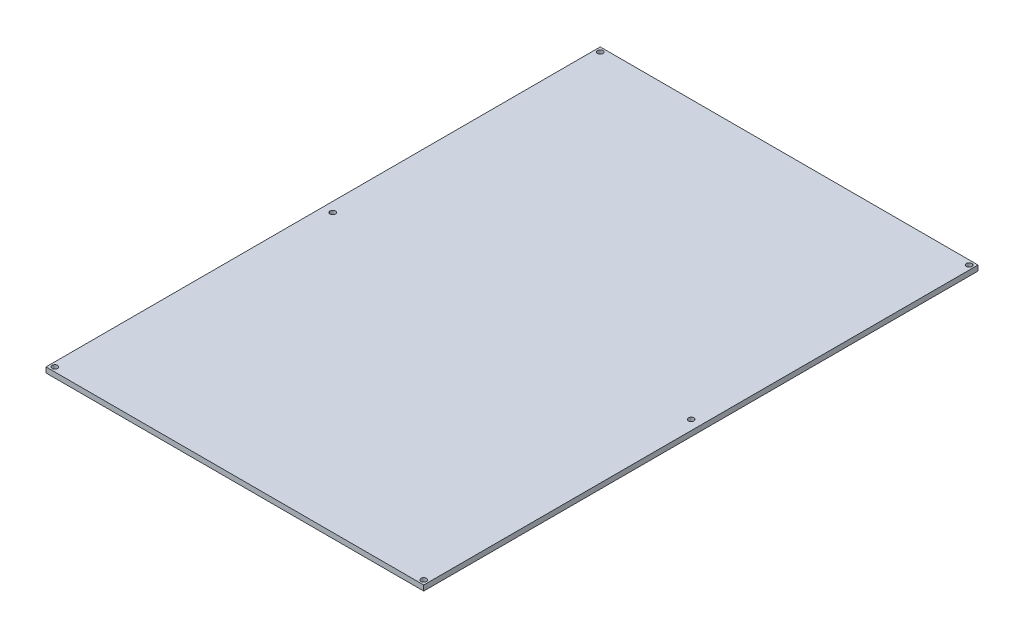
ISO-10303-21;
HEADER;
FILE_DESCRIPTION(('STEP AP214'),'2;1');
FILE_NAME('part.step','',(''),(''),'','','');
FILE_SCHEMA(('AUTOMOTIVE_DESIGN { 1 0 10303 214 1 1 1 1 }'));
ENDSEC;
DATA;
#1=APPLICATION_CONTEXT('core data for automotive mechanical design processes');
#2=APPLICATION_PROTOCOL_DEFINITION('international standard','automotive_design',2000,#1);
#3=PRODUCT_CONTEXT('',#1,'mechanical');
#4=PRODUCT('Part','Part','',(#3));
#5=PRODUCT_RELATED_PRODUCT_CATEGORY('part','',(#4));
#6=PRODUCT_DEFINITION_FORMATION('','',#4);
#7=PRODUCT_DEFINITION_CONTEXT('part definition',#1,'design');
#8=PRODUCT_DEFINITION('design','',#6,#7);
#9=PRODUCT_DEFINITION_SHAPE('','',#8);
#10=(LENGTH_UNIT() NAMED_UNIT(*) SI_UNIT(.MILLI.,.METRE.));
#11=(NAMED_UNIT(*) PLANE_ANGLE_UNIT() SI_UNIT($,.RADIAN.));
#12=(NAMED_UNIT(*) SI_UNIT($,.STERADIAN.) SOLID_ANGLE_UNIT());
#13=UNCERTAINTY_MEASURE_WITH_UNIT(LENGTH_MEASURE(1.E-05),#10,'distance_accuracy_value','');
#14=(GEOMETRIC_REPRESENTATION_CONTEXT(3) GLOBAL_UNCERTAINTY_ASSIGNED_CONTEXT((#13)) GLOBAL_UNIT_ASSIGNED_CONTEXT((#10,
#11,#12)) REPRESENTATION_CONTEXT('',''));
#15=CARTESIAN_POINT('',(0.,0.,0.));
#16=DIRECTION('',(0.,0.,1.));
#17=DIRECTION('',(1.,0.,0.));
#18=AXIS2_PLACEMENT_3D('',#15,#16,#17);
#19=CARTESIAN_POINT('',(0.,3.,0.));
#20=DIRECTION('',(0.,-1.,0.));
#21=DIRECTION('',(0.,0.,-1.));
#22=AXIS2_PLACEMENT_3D('',#19,#20,#21);
#23=PLANE('',#22);
#24=DIRECTION('',(0.,0.,1.));
#25=VECTOR('',#24,1.);
#26=CARTESIAN_POINT('',(0.,3.,0.));
#27=LINE('',#26,#25);
#28=CARTESIAN_POINT('',(-1.11022302462516E-13,3.,-314.));
#29=VERTEX_POINT('',#28);
#30=CARTESIAN_POINT('',(0.,3.,0.));
#31=VERTEX_POINT('',#30);
#32=EDGE_CURVE('E100',#29,#31,#27,.T.);
#33=ORIENTED_EDGE('',*,*,#32,.T.);
#34=DIRECTION('',(1.,0.,0.));
#35=VECTOR('',#34,1.);
#36=CARTESIAN_POINT('',(0.,3.,0.));
#37=LINE('',#36,#35);
#38=CARTESIAN_POINT('',(214.,3.,0.));
#39=VERTEX_POINT('',#38);
#40=EDGE_CURVE('E95',#31,#39,#37,.T.);
#41=ORIENTED_EDGE('',*,*,#40,.T.);
#42=DIRECTION('',(0.,0.,-1.));
#43=VECTOR('',#42,1.);
#44=CARTESIAN_POINT('',(214.,3.,0.));
#45=LINE('',#44,#43);
#46=CARTESIAN_POINT('',(214.,3.,-314.));
#47=VERTEX_POINT('',#46);
#48=EDGE_CURVE('E98',#39,#47,#45,.T.);
#49=ORIENTED_EDGE('',*,*,#48,.T.);
#50=DIRECTION('',(-1.,0.,0.));
#51=VECTOR('',#50,1.);
#52=CARTESIAN_POINT('',(-1.11022302462516E-13,3.,-314.));
#53=LINE('',#52,#51);
#54=EDGE_CURVE('E61',#47,#29,#53,.T.);
#55=ORIENTED_EDGE('',*,*,#54,.T.);
#56=EDGE_LOOP('',(#33,#41,#49,#55));
#57=FACE_BOUND('',#56,.T.);
#58=CARTESIAN_POINT('',(2.5,3.,-311.5));
#59=DIRECTION('',(0.,1.,0.));
#60=DIRECTION('',(0.,0.,1.));
#61=AXIS2_PLACEMENT_3D('',#58,#59,#60);
#62=CIRCLE('',#61,1.55000000000003);
#63=CARTESIAN_POINT('',(2.5,3.,-309.95));
#64=VERTEX_POINT('',#63);
#65=EDGE_CURVE('E122',#64,#64,#62,.T.);
#66=ORIENTED_EDGE('',*,*,#65,.F.);
#67=EDGE_LOOP('',(#66));
#68=FACE_BOUND('',#67,.T.);
#69=CARTESIAN_POINT('',(211.5,3.,-311.5));
#70=DIRECTION('',(0.,1.,0.));
#71=DIRECTION('',(0.,0.,-1.));
#72=AXIS2_PLACEMENT_3D('',#69,#70,#71);
#73=CIRCLE('',#72,1.55);
#74=CARTESIAN_POINT('',(211.5,3.,-313.05));
#75=VERTEX_POINT('',#74);
#76=EDGE_CURVE('E142',#75,#75,#73,.T.);
#77=ORIENTED_EDGE('',*,*,#76,.F.);
#78=EDGE_LOOP('',(#77));
#79=FACE_BOUND('',#78,.T.);
#80=CARTESIAN_POINT('',(2.50000000000009,3.,-2.49999999999998));
#81=DIRECTION('',(0.,1.,0.));
#82=DIRECTION('',(0.,0.,-1.));
#83=AXIS2_PLACEMENT_3D('',#80,#81,#82);
#84=CIRCLE('',#83,1.55000000000001);
#85=CARTESIAN_POINT('',(2.50000000000009,3.,-4.04999999999998));
#86=VERTEX_POINT('',#85);
#87=EDGE_CURVE('E149',#86,#86,#84,.T.);
#88=ORIENTED_EDGE('',*,*,#87,.F.);
#89=EDGE_LOOP('',(#88));
#90=FACE_BOUND('',#89,.T.);
#91=CARTESIAN_POINT('',(211.5,3.,-2.5));
#92=DIRECTION('',(0.,1.,0.));
#93=DIRECTION('',(0.,0.,1.));
#94=AXIS2_PLACEMENT_3D('',#91,#92,#93);
#95=CIRCLE('',#94,1.54999999999999);
#96=CARTESIAN_POINT('',(211.5,3.,-0.950000000000008));
#97=VERTEX_POINT('',#96);
#98=EDGE_CURVE('E156',#97,#97,#95,.T.);
#99=ORIENTED_EDGE('',*,*,#98,.F.);
#100=EDGE_LOOP('',(#99));
#101=FACE_BOUND('',#100,.T.);
#102=CARTESIAN_POINT('',(5.50000000000003,3.,-157.));
#103=DIRECTION('',(0.,1.,0.));
#104=DIRECTION('',(0.,0.,1.));
#105=AXIS2_PLACEMENT_3D('',#102,#103,#104);
#106=CIRCLE('',#105,1.55);
#107=CARTESIAN_POINT('',(5.50000000000003,3.,-155.45));
#108=VERTEX_POINT('',#107);
#109=EDGE_CURVE('E163',#108,#108,#106,.T.);
#110=ORIENTED_EDGE('',*,*,#109,.F.);
#111=EDGE_LOOP('',(#110));
#112=FACE_BOUND('',#111,.T.);
#113=CARTESIAN_POINT('',(208.5,3.,-157.));
#114=DIRECTION('',(0.,1.,0.));
#115=DIRECTION('',(0.,0.,-1.));
#116=AXIS2_PLACEMENT_3D('',#113,#114,#115);
#117=CIRCLE('',#116,1.54999999999999);
#118=CARTESIAN_POINT('',(208.5,3.,-158.55));
#119=VERTEX_POINT('',#118);
#120=EDGE_CURVE('E171',#119,#119,#117,.T.);
#121=ORIENTED_EDGE('',*,*,#120,.F.);
#122=EDGE_LOOP('',(#121));
#123=FACE_BOUND('',#122,.T.);
#124=ADVANCED_FACE('F41',(#57,#68,#79,#90,#101,#112,#123),#23,.F.);
#125=CARTESIAN_POINT('',(0.,0.,0.));
#126=DIRECTION('',(0.,-1.,0.));
#127=DIRECTION('',(0.,0.,-1.));
#128=AXIS2_PLACEMENT_3D('',#125,#126,#127);
#129=PLANE('',#128);
#130=CARTESIAN_POINT('',(5.50000000000003,0.,-157.));
#131=DIRECTION('',(0.,1.,0.));
#132=DIRECTION('',(0.,0.,1.));
#133=AXIS2_PLACEMENT_3D('',#130,#131,#132);
#134=CIRCLE('',#133,1.55);
#135=CARTESIAN_POINT('',(5.50000000000003,0.,-155.45));
#136=VERTEX_POINT('',#135);
#137=EDGE_CURVE('E167',#136,#136,#134,.T.);
#138=ORIENTED_EDGE('',*,*,#137,.T.);
#139=EDGE_LOOP('',(#138));
#140=FACE_BOUND('',#139,.T.);
#141=CARTESIAN_POINT('',(2.50000000000009,0.,-2.49999999999998));
#142=DIRECTION('',(0.,1.,0.));
#143=DIRECTION('',(0.,0.,-1.));
#144=AXIS2_PLACEMENT_3D('',#141,#142,#143);
#145=CIRCLE('',#144,1.55000000000001);
#146=CARTESIAN_POINT('',(2.50000000000009,0.,-4.04999999999998));
#147=VERTEX_POINT('',#146);
#148=EDGE_CURVE('E152',#147,#147,#145,.T.);
#149=ORIENTED_EDGE('',*,*,#148,.T.);
#150=EDGE_LOOP('',(#149));
#151=FACE_BOUND('',#150,.T.);
#152=CARTESIAN_POINT('',(2.5,0.,-311.5));
#153=DIRECTION('',(0.,1.,0.));
#154=DIRECTION('',(0.,0.,1.));
#155=AXIS2_PLACEMENT_3D('',#152,#153,#154);
#156=CIRCLE('',#155,1.55000000000003);
#157=CARTESIAN_POINT('',(2.5,0.,-309.95));
#158=VERTEX_POINT('',#157);
#159=EDGE_CURVE('E138',#158,#158,#156,.T.);
#160=ORIENTED_EDGE('',*,*,#159,.T.);
#161=EDGE_LOOP('',(#160));
#162=FACE_BOUND('',#161,.T.);
#163=DIRECTION('',(0.,0.,1.));
#164=VECTOR('',#163,1.);
#165=CARTESIAN_POINT('',(0.,0.,0.));
#166=LINE('',#165,#164);
#167=CARTESIAN_POINT('',(-1.11022302462516E-13,0.,-314.));
#168=VERTEX_POINT('',#167);
#169=CARTESIAN_POINT('',(0.,0.,0.));
#170=VERTEX_POINT('',#169);
#171=EDGE_CURVE('E118',#168,#170,#166,.T.);
#172=ORIENTED_EDGE('',*,*,#171,.F.);
#173=DIRECTION('',(-1.,0.,0.));
#174=VECTOR('',#173,1.);
#175=CARTESIAN_POINT('',(-1.11022302462516E-13,0.,-314.));
#176=LINE('',#175,#174);
#177=CARTESIAN_POINT('',(214.,0.,-314.));
#178=VERTEX_POINT('',#177);
#179=EDGE_CURVE('E86',#178,#168,#176,.T.);
#180=ORIENTED_EDGE('',*,*,#179,.F.);
#181=DIRECTION('',(0.,0.,-1.));
#182=VECTOR('',#181,1.);
#183=CARTESIAN_POINT('',(214.,0.,0.));
#184=LINE('',#183,#182);
#185=CARTESIAN_POINT('',(214.,0.,0.));
#186=VERTEX_POINT('',#185);
#187=EDGE_CURVE('E80',#186,#178,#184,.T.);
#188=ORIENTED_EDGE('',*,*,#187,.F.);
#189=DIRECTION('',(1.,0.,0.));
#190=VECTOR('',#189,1.);
#191=CARTESIAN_POINT('',(0.,0.,0.));
#192=LINE('',#191,#190);
#193=EDGE_CURVE('E105',#170,#186,#192,.T.);
#194=ORIENTED_EDGE('',*,*,#193,.F.);
#195=EDGE_LOOP('',(#172,#180,#188,#194));
#196=FACE_BOUND('',#195,.T.);
#197=CARTESIAN_POINT('',(211.5,0.,-311.5));
#198=DIRECTION('',(0.,1.,0.));
#199=DIRECTION('',(0.,0.,-1.));
#200=AXIS2_PLACEMENT_3D('',#197,#198,#199);
#201=CIRCLE('',#200,1.55);
#202=CARTESIAN_POINT('',(211.5,0.,-313.05));
#203=VERTEX_POINT('',#202);
#204=EDGE_CURVE('E146',#203,#203,#201,.T.);
#205=ORIENTED_EDGE('',*,*,#204,.T.);
#206=EDGE_LOOP('',(#205));
#207=FACE_BOUND('',#206,.T.);
#208=CARTESIAN_POINT('',(211.5,0.,-2.5));
#209=DIRECTION('',(0.,1.,0.));
#210=DIRECTION('',(0.,0.,1.));
#211=AXIS2_PLACEMENT_3D('',#208,#209,#210);
#212=CIRCLE('',#211,1.54999999999999);
#213=CARTESIAN_POINT('',(211.5,0.,-0.950000000000008));
#214=VERTEX_POINT('',#213);
#215=EDGE_CURVE('E160',#214,#214,#212,.T.);
#216=ORIENTED_EDGE('',*,*,#215,.T.);
#217=EDGE_LOOP('',(#216));
#218=FACE_BOUND('',#217,.T.);
#219=CARTESIAN_POINT('',(208.5,0.,-157.));
#220=DIRECTION('',(0.,1.,0.));
#221=DIRECTION('',(0.,0.,-1.));
#222=AXIS2_PLACEMENT_3D('',#219,#220,#221);
#223=CIRCLE('',#222,1.54999999999999);
#224=CARTESIAN_POINT('',(208.5,0.,-158.55));
#225=VERTEX_POINT('',#224);
#226=EDGE_CURVE('E175',#225,#225,#223,.T.);
#227=ORIENTED_EDGE('',*,*,#226,.T.);
#228=EDGE_LOOP('',(#227));
#229=FACE_BOUND('',#228,.T.);
#230=ADVANCED_FACE('F133',(#140,#151,#162,#196,#207,#218,#229),#129,.T.);
#231=CARTESIAN_POINT('',(0.,3.,0.));
#232=DIRECTION('',(1.,0.,0.));
#233=DIRECTION('',(0.,0.,-1.));
#234=AXIS2_PLACEMENT_3D('',#231,#232,#233);
#235=PLANE('',#234);
#236=ORIENTED_EDGE('',*,*,#171,.T.);
#237=DIRECTION('',(0.,-1.,0.));
#238=VECTOR('',#237,1.);
#239=CARTESIAN_POINT('',(0.,3.,0.));
#240=LINE('',#239,#238);
#241=EDGE_CURVE('E11',#31,#170,#240,.T.);
#242=ORIENTED_EDGE('',*,*,#241,.F.);
#243=ORIENTED_EDGE('',*,*,#32,.F.);
#244=DIRECTION('',(0.,-1.,0.));
#245=VECTOR('',#244,1.);
#246=CARTESIAN_POINT('',(-1.11022302462516E-13,3.,-314.));
#247=LINE('',#246,#245);
#248=EDGE_CURVE('E114',#29,#168,#247,.T.);
#249=ORIENTED_EDGE('',*,*,#248,.T.);
#250=EDGE_LOOP('',(#236,#242,#243,#249));
#251=FACE_BOUND('',#250,.T.);
#252=ADVANCED_FACE('F43',(#251),#235,.F.);
#253=CARTESIAN_POINT('',(0.,3.,0.));
#254=DIRECTION('',(0.,0.,-1.));
#255=DIRECTION('',(-1.,0.,0.));
#256=AXIS2_PLACEMENT_3D('',#253,#254,#255);
#257=PLANE('',#256);
#258=ORIENTED_EDGE('',*,*,#193,.T.);
#259=DIRECTION('',(0.,-1.,0.));
#260=VECTOR('',#259,1.);
#261=CARTESIAN_POINT('',(214.,3.,0.));
#262=LINE('',#261,#260);
#263=EDGE_CURVE('E51',#39,#186,#262,.T.);
#264=ORIENTED_EDGE('',*,*,#263,.F.);
#265=ORIENTED_EDGE('',*,*,#40,.F.);
#266=ORIENTED_EDGE('',*,*,#241,.T.);
#267=EDGE_LOOP('',(#258,#264,#265,#266));
#268=FACE_BOUND('',#267,.T.);
#269=ADVANCED_FACE('F104',(#268),#257,.F.);
#270=CARTESIAN_POINT('',(214.,3.,0.));
#271=DIRECTION('',(-1.,0.,0.));
#272=DIRECTION('',(0.,0.,1.));
#273=AXIS2_PLACEMENT_3D('',#270,#271,#272);
#274=PLANE('',#273);
#275=ORIENTED_EDGE('',*,*,#187,.T.);
#276=DIRECTION('',(0.,-1.,0.));
#277=VECTOR('',#276,1.);
#278=CARTESIAN_POINT('',(214.,3.,-314.));
#279=LINE('',#278,#277);
#280=EDGE_CURVE('E107',#47,#178,#279,.T.);
#281=ORIENTED_EDGE('',*,*,#280,.F.);
#282=ORIENTED_EDGE('',*,*,#48,.F.);
#283=ORIENTED_EDGE('',*,*,#263,.T.);
#284=EDGE_LOOP('',(#275,#281,#282,#283));
#285=FACE_BOUND('',#284,.T.);
#286=ADVANCED_FACE('F108',(#285),#274,.F.);
#287=CARTESIAN_POINT('',(-1.11022302462516E-13,3.,-314.));
#288=DIRECTION('',(0.,0.,1.));
#289=DIRECTION('',(1.,0.,0.));
#290=AXIS2_PLACEMENT_3D('',#287,#288,#289);
#291=PLANE('',#290);
#292=ORIENTED_EDGE('',*,*,#179,.T.);
#293=ORIENTED_EDGE('',*,*,#248,.F.);
#294=ORIENTED_EDGE('',*,*,#54,.F.);
#295=ORIENTED_EDGE('',*,*,#280,.T.);
#296=EDGE_LOOP('',(#292,#293,#294,#295));
#297=FACE_BOUND('',#296,.T.);
#298=ADVANCED_FACE('F130',(#297),#291,.F.);
#299=CARTESIAN_POINT('',(2.5,3.,-311.5));
#300=DIRECTION('',(0.,-1.,0.));
#301=DIRECTION('',(0.,0.,-1.));
#302=AXIS2_PLACEMENT_3D('',#299,#300,#301);
#303=CYLINDRICAL_SURFACE('',#302,1.55000000000003);
#304=ORIENTED_EDGE('',*,*,#65,.T.);
#305=EDGE_LOOP('',(#304));
#306=FACE_BOUND('',#305,.T.);
#307=ORIENTED_EDGE('',*,*,#159,.F.);
#308=EDGE_LOOP('',(#307));
#309=FACE_BOUND('',#308,.T.);
#310=ADVANCED_FACE('F193',(#306,#309),#303,.F.);
#311=CARTESIAN_POINT('',(211.5,3.,-311.5));
#312=DIRECTION('',(0.,-1.,0.));
#313=DIRECTION('',(0.,0.,-1.));
#314=AXIS2_PLACEMENT_3D('',#311,#312,#313);
#315=CYLINDRICAL_SURFACE('',#314,1.55);
#316=ORIENTED_EDGE('',*,*,#76,.T.);
#317=EDGE_LOOP('',(#316));
#318=FACE_BOUND('',#317,.T.);
#319=ORIENTED_EDGE('',*,*,#204,.F.);
#320=EDGE_LOOP('',(#319));
#321=FACE_BOUND('',#320,.T.);
#322=ADVANCED_FACE('F247',(#318,#321),#315,.F.);
#323=CARTESIAN_POINT('',(2.50000000000009,3.,-2.49999999999998));
#324=DIRECTION('',(0.,-1.,0.));
#325=DIRECTION('',(0.,0.,-1.));
#326=AXIS2_PLACEMENT_3D('',#323,#324,#325);
#327=CYLINDRICAL_SURFACE('',#326,1.55000000000001);
#328=ORIENTED_EDGE('',*,*,#87,.T.);
#329=EDGE_LOOP('',(#328));
#330=FACE_BOUND('',#329,.T.);
#331=ORIENTED_EDGE('',*,*,#148,.F.);
#332=EDGE_LOOP('',(#331));
#333=FACE_BOUND('',#332,.T.);
#334=ADVANCED_FACE('F255',(#330,#333),#327,.F.);
#335=CARTESIAN_POINT('',(211.5,3.,-2.5));
#336=DIRECTION('',(0.,-1.,0.));
#337=DIRECTION('',(0.,0.,-1.));
#338=AXIS2_PLACEMENT_3D('',#335,#336,#337);
#339=CYLINDRICAL_SURFACE('',#338,1.54999999999999);
#340=ORIENTED_EDGE('',*,*,#98,.T.);
#341=EDGE_LOOP('',(#340));
#342=FACE_BOUND('',#341,.T.);
#343=ORIENTED_EDGE('',*,*,#215,.F.);
#344=EDGE_LOOP('',(#343));
#345=FACE_BOUND('',#344,.T.);
#346=ADVANCED_FACE('F263',(#342,#345),#339,.F.);
#347=CARTESIAN_POINT('',(5.50000000000003,3.,-157.));
#348=DIRECTION('',(0.,-1.,0.));
#349=DIRECTION('',(0.,0.,-1.));
#350=AXIS2_PLACEMENT_3D('',#347,#348,#349);
#351=CYLINDRICAL_SURFACE('',#350,1.55);
#352=ORIENTED_EDGE('',*,*,#109,.T.);
#353=EDGE_LOOP('',(#352));
#354=FACE_BOUND('',#353,.T.);
#355=ORIENTED_EDGE('',*,*,#137,.F.);
#356=EDGE_LOOP('',(#355));
#357=FACE_BOUND('',#356,.T.);
#358=ADVANCED_FACE('F272',(#354,#357),#351,.F.);
#359=CARTESIAN_POINT('',(208.5,3.,-157.));
#360=DIRECTION('',(0.,-1.,0.));
#361=DIRECTION('',(0.,0.,-1.));
#362=AXIS2_PLACEMENT_3D('',#359,#360,#361);
#363=CYLINDRICAL_SURFACE('',#362,1.54999999999999);
#364=ORIENTED_EDGE('',*,*,#120,.T.);
#365=EDGE_LOOP('',(#364));
#366=FACE_BOUND('',#365,.T.);
#367=ORIENTED_EDGE('',*,*,#226,.F.);
#368=EDGE_LOOP('',(#367));
#369=FACE_BOUND('',#368,.T.);
#370=ADVANCED_FACE('F182',(#366,#369),#363,.F.);
#371=CLOSED_SHELL('',(#124,#230,#252,#269,#286,#298,#310,#322,#334,#346,#358,#370));
#372=MANIFOLD_SOLID_BREP('B2',#371);
#373=ADVANCED_BREP_SHAPE_REPRESENTATION('',(#18,#372),#14);
#374=SHAPE_DEFINITION_REPRESENTATION(#9,#373);
ENDSEC;
END-ISO-10303-21;
